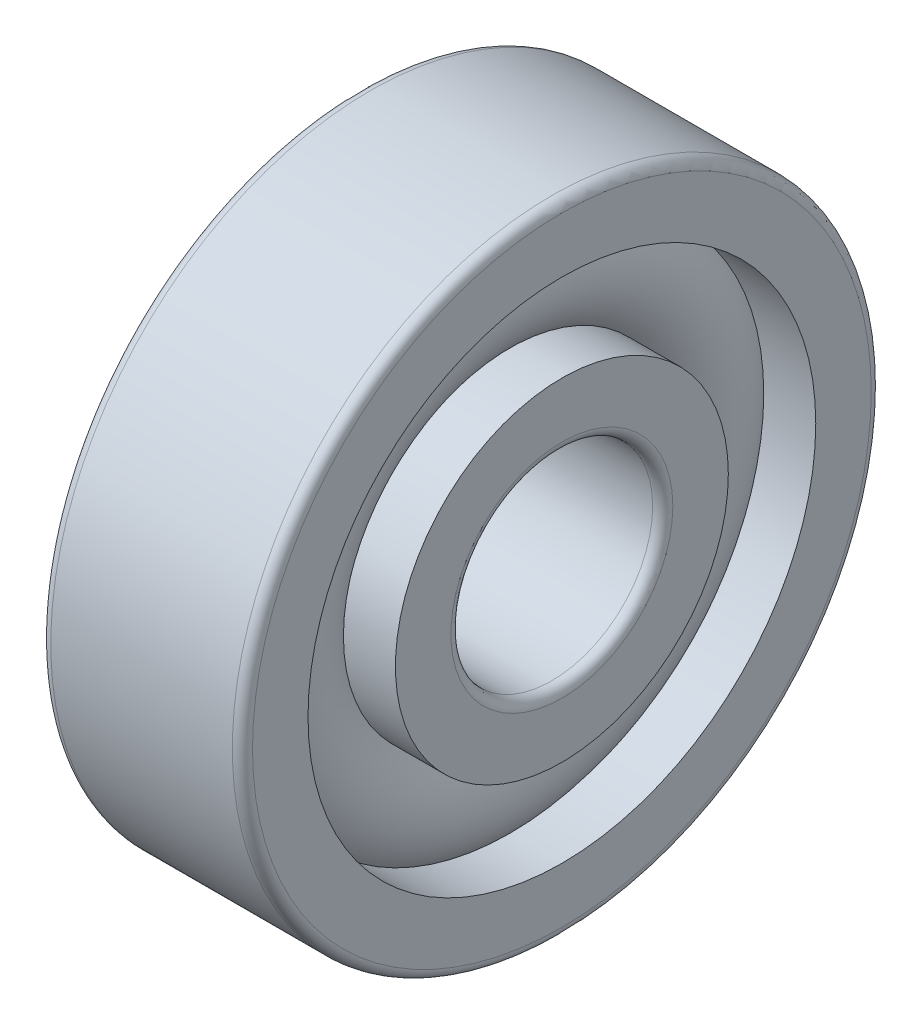
ISO-10303-21;
HEADER;
FILE_DESCRIPTION(('STEP AP214'),'2;1');
FILE_NAME('part.step','',(''),(''),'','','');
FILE_SCHEMA(('AUTOMOTIVE_DESIGN { 1 0 10303 214 1 1 1 1 }'));
ENDSEC;
DATA;
#1=APPLICATION_CONTEXT('core data for automotive mechanical design processes');
#2=APPLICATION_PROTOCOL_DEFINITION('international standard','automotive_design',2000,#1);
#3=PRODUCT_CONTEXT('',#1,'mechanical');
#4=PRODUCT('Part','Part','',(#3));
#5=PRODUCT_RELATED_PRODUCT_CATEGORY('part','',(#4));
#6=PRODUCT_DEFINITION_FORMATION('','',#4);
#7=PRODUCT_DEFINITION_CONTEXT('part definition',#1,'design');
#8=PRODUCT_DEFINITION('design','',#6,#7);
#9=PRODUCT_DEFINITION_SHAPE('','',#8);
#10=(LENGTH_UNIT() NAMED_UNIT(*) SI_UNIT(.MILLI.,.METRE.));
#11=(NAMED_UNIT(*) PLANE_ANGLE_UNIT() SI_UNIT($,.RADIAN.));
#12=(NAMED_UNIT(*) SI_UNIT($,.STERADIAN.) SOLID_ANGLE_UNIT());
#13=UNCERTAINTY_MEASURE_WITH_UNIT(LENGTH_MEASURE(1.E-05),#10,'distance_accuracy_value','');
#14=(GEOMETRIC_REPRESENTATION_CONTEXT(3) GLOBAL_UNCERTAINTY_ASSIGNED_CONTEXT((#13)) GLOBAL_UNIT_ASSIGNED_CONTEXT((#10,
#11,#12)) REPRESENTATION_CONTEXT('',''));
#15=CARTESIAN_POINT('',(0.,0.,0.));
#16=DIRECTION('',(0.,0.,1.));
#17=DIRECTION('',(1.,0.,0.));
#18=AXIS2_PLACEMENT_3D('',#15,#16,#17);
#19=CARTESIAN_POINT('',(0.,0.,0.));
#20=DIRECTION('',(-1.,0.,0.));
#21=DIRECTION('',(0.,0.,1.));
#22=AXIS2_PLACEMENT_3D('',#19,#20,#21);
#23=TOROIDAL_SURFACE('',#22,6.25,1.95);
#24=CARTESIAN_POINT('',(1.45344418537486,0.,0.));
#25=DIRECTION('',(-1.,0.,0.));
#26=DIRECTION('',(0.,0.,1.));
#27=AXIS2_PLACEMENT_3D('',#24,#25,#26);
#28=CIRCLE('',#27,7.55);
#29=CARTESIAN_POINT('',(1.45344418537486,0.,7.55));
#30=VERTEX_POINT('',#29);
#31=EDGE_CURVE('E35',#30,#30,#28,.F.);
#32=ORIENTED_EDGE('',*,*,#31,.T.);
#33=EDGE_LOOP('',(#32));
#34=FACE_BOUND('',#33,.T.);
#35=CARTESIAN_POINT('',(1.45344418537486,0.,0.));
#36=DIRECTION('',(-1.,0.,0.));
#37=DIRECTION('',(0.,0.,1.));
#38=AXIS2_PLACEMENT_3D('',#35,#36,#37);
#39=CIRCLE('',#38,4.95);
#40=CARTESIAN_POINT('',(1.45344418537486,0.,4.95));
#41=VERTEX_POINT('',#40);
#42=EDGE_CURVE('E10',#41,#41,#39,.T.);
#43=ORIENTED_EDGE('',*,*,#42,.T.);
#44=EDGE_LOOP('',(#43));
#45=FACE_BOUND('',#44,.T.);
#46=ADVANCED_FACE('F31',(#34,#45),#23,.T.);
#47=CARTESIAN_POINT('',(-20.6375,0.,0.));
#48=DIRECTION('',(1.,0.,0.));
#49=DIRECTION('',(0.,0.,-1.));
#50=AXIS2_PLACEMENT_3D('',#47,#48,#49);
#51=CYLINDRICAL_SURFACE('',#50,4.95);
#52=CARTESIAN_POINT('',(3.,0.,0.));
#53=DIRECTION('',(1.,0.,0.));
#54=DIRECTION('',(0.,0.,-1.));
#55=AXIS2_PLACEMENT_3D('',#52,#53,#54);
#56=CIRCLE('',#55,4.95);
#57=CARTESIAN_POINT('',(3.,0.,-4.95));
#58=VERTEX_POINT('',#57);
#59=EDGE_CURVE('E44',#58,#58,#56,.T.);
#60=ORIENTED_EDGE('',*,*,#59,.F.);
#61=EDGE_LOOP('',(#60));
#62=FACE_BOUND('',#61,.T.);
#63=ORIENTED_EDGE('',*,*,#42,.F.);
#64=EDGE_LOOP('',(#63));
#65=FACE_BOUND('',#64,.T.);
#66=ADVANCED_FACE('F83',(#62,#65),#51,.T.);
#67=CARTESIAN_POINT('',(-20.6375,0.,0.));
#68=DIRECTION('',(1.,0.,0.));
#69=DIRECTION('',(0.,0.,-1.));
#70=AXIS2_PLACEMENT_3D('',#67,#68,#69);
#71=CYLINDRICAL_SURFACE('',#70,4.95);
#72=CARTESIAN_POINT('',(-3.,0.,0.));
#73=DIRECTION('',(1.,0.,0.));
#74=DIRECTION('',(0.,0.,-1.));
#75=AXIS2_PLACEMENT_3D('',#72,#73,#74);
#76=CIRCLE('',#75,4.95);
#77=CARTESIAN_POINT('',(-3.,0.,-4.95));
#78=VERTEX_POINT('',#77);
#79=EDGE_CURVE('E53',#78,#78,#76,.T.);
#80=ORIENTED_EDGE('',*,*,#79,.T.);
#81=EDGE_LOOP('',(#80));
#82=FACE_BOUND('',#81,.T.);
#83=CARTESIAN_POINT('',(-1.45344418537486,0.,0.));
#84=DIRECTION('',(1.,0.,0.));
#85=DIRECTION('',(0.,0.,-1.));
#86=AXIS2_PLACEMENT_3D('',#83,#84,#85);
#87=CIRCLE('',#86,4.95);
#88=CARTESIAN_POINT('',(-1.45344418537486,0.,-4.95));
#89=VERTEX_POINT('',#88);
#90=EDGE_CURVE('E39',#89,#89,#87,.T.);
#91=ORIENTED_EDGE('',*,*,#90,.F.);
#92=EDGE_LOOP('',(#91));
#93=FACE_BOUND('',#92,.T.);
#94=ADVANCED_FACE('F86',(#82,#93),#71,.T.);
#95=CARTESIAN_POINT('',(3.,3.3,0.));
#96=DIRECTION('',(1.,0.,0.));
#97=DIRECTION('',(0.,0.,-1.));
#98=AXIS2_PLACEMENT_3D('',#95,#96,#97);
#99=PLANE('',#98);
#100=ORIENTED_EDGE('',*,*,#59,.T.);
#101=EDGE_LOOP('',(#100));
#102=FACE_BOUND('',#101,.T.);
#103=CARTESIAN_POINT('',(3.,0.,0.));
#104=DIRECTION('',(1.,0.,0.));
#105=DIRECTION('',(0.,0.,-1.));
#106=AXIS2_PLACEMENT_3D('',#103,#104,#105);
#107=CIRCLE('',#106,3.3);
#108=CARTESIAN_POINT('',(3.,0.,-3.3));
#109=VERTEX_POINT('',#108);
#110=EDGE_CURVE('E75',#109,#109,#107,.T.);
#111=ORIENTED_EDGE('',*,*,#110,.F.);
#112=EDGE_LOOP('',(#111));
#113=FACE_BOUND('',#112,.T.);
#114=ADVANCED_FACE('F80',(#102,#113),#99,.T.);
#115=CARTESIAN_POINT('',(2.7,0.,0.));
#116=DIRECTION('',(1.,0.,0.));
#117=DIRECTION('',(0.,0.,-1.));
#118=AXIS2_PLACEMENT_3D('',#115,#116,#117);
#119=TOROIDAL_SURFACE('',#118,3.3,0.3);
#120=ORIENTED_EDGE('',*,*,#110,.T.);
#121=EDGE_LOOP('',(#120));
#122=FACE_BOUND('',#121,.T.);
#123=CARTESIAN_POINT('',(2.7,0.,0.));
#124=DIRECTION('',(1.,0.,0.));
#125=DIRECTION('',(0.,0.,-1.));
#126=AXIS2_PLACEMENT_3D('',#123,#124,#125);
#127=CIRCLE('',#126,3.);
#128=CARTESIAN_POINT('',(2.7,0.,-3.));
#129=VERTEX_POINT('',#128);
#130=EDGE_CURVE('E72',#129,#129,#127,.T.);
#131=ORIENTED_EDGE('',*,*,#130,.F.);
#132=EDGE_LOOP('',(#131));
#133=FACE_BOUND('',#132,.T.);
#134=ADVANCED_FACE('F97',(#122,#133),#119,.T.);
#135=CARTESIAN_POINT('',(-20.6375,0.,0.));
#136=DIRECTION('',(1.,0.,0.));
#137=DIRECTION('',(0.,0.,-1.));
#138=AXIS2_PLACEMENT_3D('',#135,#136,#137);
#139=CYLINDRICAL_SURFACE('',#138,3.);
#140=ORIENTED_EDGE('',*,*,#130,.T.);
#141=EDGE_LOOP('',(#140));
#142=FACE_BOUND('',#141,.T.);
#143=CARTESIAN_POINT('',(-2.7,0.,0.));
#144=DIRECTION('',(1.,0.,0.));
#145=DIRECTION('',(0.,0.,-1.));
#146=AXIS2_PLACEMENT_3D('',#143,#144,#145);
#147=CIRCLE('',#146,3.);
#148=CARTESIAN_POINT('',(-2.7,0.,-3.));
#149=VERTEX_POINT('',#148);
#150=EDGE_CURVE('E69',#149,#149,#147,.T.);
#151=ORIENTED_EDGE('',*,*,#150,.F.);
#152=EDGE_LOOP('',(#151));
#153=FACE_BOUND('',#152,.T.);
#154=ADVANCED_FACE('F100',(#142,#153),#139,.F.);
#155=CARTESIAN_POINT('',(-2.7,0.,0.));
#156=DIRECTION('',(1.,0.,0.));
#157=DIRECTION('',(0.,0.,-1.));
#158=AXIS2_PLACEMENT_3D('',#155,#156,#157);
#159=TOROIDAL_SURFACE('',#158,3.3,0.3);
#160=ORIENTED_EDGE('',*,*,#150,.T.);
#161=EDGE_LOOP('',(#160));
#162=FACE_BOUND('',#161,.T.);
#163=CARTESIAN_POINT('',(-3.,0.,0.));
#164=DIRECTION('',(1.,0.,0.));
#165=DIRECTION('',(0.,0.,-1.));
#166=AXIS2_PLACEMENT_3D('',#163,#164,#165);
#167=CIRCLE('',#166,3.3);
#168=CARTESIAN_POINT('',(-3.,0.,-3.3));
#169=VERTEX_POINT('',#168);
#170=EDGE_CURVE('E66',#169,#169,#167,.T.);
#171=ORIENTED_EDGE('',*,*,#170,.F.);
#172=EDGE_LOOP('',(#171));
#173=FACE_BOUND('',#172,.T.);
#174=ADVANCED_FACE('F104',(#162,#173),#159,.T.);
#175=CARTESIAN_POINT('',(-3.,4.95,0.));
#176=DIRECTION('',(-1.,0.,0.));
#177=DIRECTION('',(0.,0.,1.));
#178=AXIS2_PLACEMENT_3D('',#175,#176,#177);
#179=PLANE('',#178);
#180=ORIENTED_EDGE('',*,*,#170,.T.);
#181=EDGE_LOOP('',(#180));
#182=FACE_BOUND('',#181,.T.);
#183=ORIENTED_EDGE('',*,*,#79,.F.);
#184=EDGE_LOOP('',(#183));
#185=FACE_BOUND('',#184,.T.);
#186=ADVANCED_FACE('F108',(#182,#185),#179,.T.);
#187=CARTESIAN_POINT('',(-1.45344418537486,0.,0.));
#188=DIRECTION('',(1.,0.,0.));
#189=DIRECTION('',(0.,0.,-1.));
#190=AXIS2_PLACEMENT_3D('',#187,#188,#189);
#191=CIRCLE('',#190,7.55);
#192=CARTESIAN_POINT('',(-1.45344418537486,0.,-7.55));
#193=VERTEX_POINT('',#192);
#194=EDGE_CURVE('E47',#193,#193,#191,.F.);
#195=ORIENTED_EDGE('',*,*,#194,.T.);
#196=EDGE_LOOP('',(#195));
#197=FACE_BOUND('',#196,.T.);
#198=ORIENTED_EDGE('',*,*,#90,.T.);
#199=EDGE_LOOP('',(#198));
#200=FACE_BOUND('',#199,.T.);
#201=ADVANCED_FACE('F33',(#197,#200),#23,.T.);
#202=CARTESIAN_POINT('',(-20.6375,0.,0.));
#203=DIRECTION('',(1.,0.,0.));
#204=DIRECTION('',(0.,0.,-1.));
#205=AXIS2_PLACEMENT_3D('',#202,#203,#204);
#206=CYLINDRICAL_SURFACE('',#205,7.55);
#207=CARTESIAN_POINT('',(3.,0.,0.));
#208=DIRECTION('',(1.,0.,0.));
#209=DIRECTION('',(0.,0.,-1.));
#210=AXIS2_PLACEMENT_3D('',#207,#208,#209);
#211=CIRCLE('',#210,7.55);
#212=CARTESIAN_POINT('',(3.,0.,-7.55));
#213=VERTEX_POINT('',#212);
#214=EDGE_CURVE('E49',#213,#213,#211,.T.);
#215=ORIENTED_EDGE('',*,*,#214,.T.);
#216=EDGE_LOOP('',(#215));
#217=FACE_BOUND('',#216,.T.);
#218=ORIENTED_EDGE('',*,*,#31,.F.);
#219=EDGE_LOOP('',(#218));
#220=FACE_BOUND('',#219,.T.);
#221=ADVANCED_FACE('F113',(#217,#220),#206,.F.);
#222=CARTESIAN_POINT('',(-20.6375,0.,0.));
#223=DIRECTION('',(1.,0.,0.));
#224=DIRECTION('',(0.,0.,-1.));
#225=AXIS2_PLACEMENT_3D('',#222,#223,#224);
#226=CYLINDRICAL_SURFACE('',#225,7.55);
#227=CARTESIAN_POINT('',(-3.,0.,0.));
#228=DIRECTION('',(1.,0.,0.));
#229=DIRECTION('',(0.,0.,-1.));
#230=AXIS2_PLACEMENT_3D('',#227,#228,#229);
#231=CIRCLE('',#230,7.55);
#232=CARTESIAN_POINT('',(-3.,0.,-7.55));
#233=VERTEX_POINT('',#232);
#234=EDGE_CURVE('E144',#233,#233,#231,.T.);
#235=ORIENTED_EDGE('',*,*,#234,.F.);
#236=EDGE_LOOP('',(#235));
#237=FACE_BOUND('',#236,.T.);
#238=ORIENTED_EDGE('',*,*,#194,.F.);
#239=EDGE_LOOP('',(#238));
#240=FACE_BOUND('',#239,.T.);
#241=ADVANCED_FACE('F116',(#237,#240),#226,.F.);
#242=CARTESIAN_POINT('',(3.,9.2,0.));
#243=DIRECTION('',(1.,0.,0.));
#244=DIRECTION('',(0.,0.,-1.));
#245=AXIS2_PLACEMENT_3D('',#242,#243,#244);
#246=PLANE('',#245);
#247=CARTESIAN_POINT('',(3.,0.,0.));
#248=DIRECTION('',(1.,0.,0.));
#249=DIRECTION('',(0.,0.,-1.));
#250=AXIS2_PLACEMENT_3D('',#247,#248,#249);
#251=CIRCLE('',#250,9.2);
#252=CARTESIAN_POINT('',(3.,0.,-9.2));
#253=VERTEX_POINT('',#252);
#254=EDGE_CURVE('E55',#253,#253,#251,.T.);
#255=ORIENTED_EDGE('',*,*,#254,.T.);
#256=EDGE_LOOP('',(#255));
#257=FACE_BOUND('',#256,.T.);
#258=ORIENTED_EDGE('',*,*,#214,.F.);
#259=EDGE_LOOP('',(#258));
#260=FACE_BOUND('',#259,.T.);
#261=ADVANCED_FACE('F117',(#257,#260),#246,.T.);
#262=CARTESIAN_POINT('',(2.7,0.,0.));
#263=DIRECTION('',(1.,0.,0.));
#264=DIRECTION('',(0.,0.,-1.));
#265=AXIS2_PLACEMENT_3D('',#262,#263,#264);
#266=TOROIDAL_SURFACE('',#265,9.2,0.299999999999999);
#267=CARTESIAN_POINT('',(2.7,0.,0.));
#268=DIRECTION('',(1.,0.,0.));
#269=DIRECTION('',(0.,0.,-1.));
#270=AXIS2_PLACEMENT_3D('',#267,#268,#269);
#271=CIRCLE('',#270,9.50000000000001);
#272=CARTESIAN_POINT('',(2.7,0.,-9.50000000000001));
#273=VERTEX_POINT('',#272);
#274=EDGE_CURVE('E60',#273,#273,#271,.T.);
#275=ORIENTED_EDGE('',*,*,#274,.T.);
#276=EDGE_LOOP('',(#275));
#277=FACE_BOUND('',#276,.T.);
#278=ORIENTED_EDGE('',*,*,#254,.F.);
#279=EDGE_LOOP('',(#278));
#280=FACE_BOUND('',#279,.T.);
#281=ADVANCED_FACE('F120',(#277,#280),#266,.T.);
#282=CARTESIAN_POINT('',(-20.6375,0.,0.));
#283=DIRECTION('',(1.,0.,0.));
#284=DIRECTION('',(0.,0.,-1.));
#285=AXIS2_PLACEMENT_3D('',#282,#283,#284);
#286=CYLINDRICAL_SURFACE('',#285,9.50000000000001);
#287=CARTESIAN_POINT('',(-2.7,0.,0.));
#288=DIRECTION('',(1.,0.,0.));
#289=DIRECTION('',(0.,0.,-1.));
#290=AXIS2_PLACEMENT_3D('',#287,#288,#289);
#291=CIRCLE('',#290,9.50000000000001);
#292=CARTESIAN_POINT('',(-2.7,0.,-9.50000000000001));
#293=VERTEX_POINT('',#292);
#294=EDGE_CURVE('E148',#293,#293,#291,.T.);
#295=ORIENTED_EDGE('',*,*,#294,.T.);
#296=EDGE_LOOP('',(#295));
#297=FACE_BOUND('',#296,.T.);
#298=ORIENTED_EDGE('',*,*,#274,.F.);
#299=EDGE_LOOP('',(#298));
#300=FACE_BOUND('',#299,.T.);
#301=ADVANCED_FACE('F124',(#297,#300),#286,.T.);
#302=CARTESIAN_POINT('',(-2.7,0.,0.));
#303=DIRECTION('',(1.,0.,0.));
#304=DIRECTION('',(0.,0.,-1.));
#305=AXIS2_PLACEMENT_3D('',#302,#303,#304);
#306=TOROIDAL_SURFACE('',#305,9.2,0.299999999999999);
#307=CARTESIAN_POINT('',(-3.,0.,0.));
#308=DIRECTION('',(1.,0.,0.));
#309=DIRECTION('',(0.,0.,-1.));
#310=AXIS2_PLACEMENT_3D('',#307,#308,#309);
#311=CIRCLE('',#310,9.2);
#312=CARTESIAN_POINT('',(-3.,0.,-9.2));
#313=VERTEX_POINT('',#312);
#314=EDGE_CURVE('E145',#313,#313,#311,.T.);
#315=ORIENTED_EDGE('',*,*,#314,.T.);
#316=EDGE_LOOP('',(#315));
#317=FACE_BOUND('',#316,.T.);
#318=ORIENTED_EDGE('',*,*,#294,.F.);
#319=EDGE_LOOP('',(#318));
#320=FACE_BOUND('',#319,.T.);
#321=ADVANCED_FACE('F128',(#317,#320),#306,.T.);
#322=CARTESIAN_POINT('',(-3.,7.55,0.));
#323=DIRECTION('',(-1.,0.,0.));
#324=DIRECTION('',(0.,0.,1.));
#325=AXIS2_PLACEMENT_3D('',#322,#323,#324);
#326=PLANE('',#325);
#327=ORIENTED_EDGE('',*,*,#234,.T.);
#328=EDGE_LOOP('',(#327));
#329=FACE_BOUND('',#328,.T.);
#330=ORIENTED_EDGE('',*,*,#314,.F.);
#331=EDGE_LOOP('',(#330));
#332=FACE_BOUND('',#331,.T.);
#333=ADVANCED_FACE('F132',(#329,#332),#326,.T.);
#334=CLOSED_SHELL('',(#46,#66,#94,#114,#134,#154,#174,#186,#201,#221,#241,#261,#281,#301,#321,#333));
#335=MANIFOLD_SOLID_BREP('B2',#334);
#336=ADVANCED_BREP_SHAPE_REPRESENTATION('',(#18,#335),#14);
#337=SHAPE_DEFINITION_REPRESENTATION(#9,#336);
ENDSEC;
END-ISO-10303-21;
